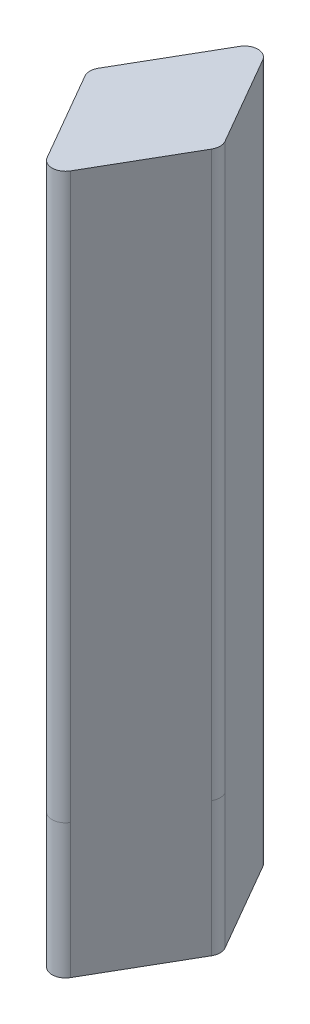
ISO-10303-21;
HEADER;
FILE_DESCRIPTION(('STEP AP214'),'2;1');
FILE_NAME('part.step','',(''),(''),'','','');
FILE_SCHEMA(('AUTOMOTIVE_DESIGN { 1 0 10303 214 1 1 1 1 }'));
ENDSEC;
DATA;
#1=APPLICATION_CONTEXT('core data for automotive mechanical design processes');
#2=APPLICATION_PROTOCOL_DEFINITION('international standard','automotive_design',2000,#1);
#3=PRODUCT_CONTEXT('',#1,'mechanical');
#4=PRODUCT('Part','Part','',(#3));
#5=PRODUCT_RELATED_PRODUCT_CATEGORY('part','',(#4));
#6=PRODUCT_DEFINITION_FORMATION('','',#4);
#7=PRODUCT_DEFINITION_CONTEXT('part definition',#1,'design');
#8=PRODUCT_DEFINITION('design','',#6,#7);
#9=PRODUCT_DEFINITION_SHAPE('','',#8);
#10=(LENGTH_UNIT() NAMED_UNIT(*) SI_UNIT(.MILLI.,.METRE.));
#11=(NAMED_UNIT(*) PLANE_ANGLE_UNIT() SI_UNIT($,.RADIAN.));
#12=(NAMED_UNIT(*) SI_UNIT($,.STERADIAN.) SOLID_ANGLE_UNIT());
#13=UNCERTAINTY_MEASURE_WITH_UNIT(LENGTH_MEASURE(1.E-05),#10,'distance_accuracy_value','');
#14=(GEOMETRIC_REPRESENTATION_CONTEXT(3) GLOBAL_UNCERTAINTY_ASSIGNED_CONTEXT((#13)) GLOBAL_UNIT_ASSIGNED_CONTEXT((#10,
#11,#12)) REPRESENTATION_CONTEXT('',''));
#15=CARTESIAN_POINT('',(0.,0.,0.));
#16=DIRECTION('',(0.,0.,1.));
#17=DIRECTION('',(1.,0.,0.));
#18=AXIS2_PLACEMENT_3D('',#15,#16,#17);
#19=CARTESIAN_POINT('',(0.,-52.,8.66025403784438));
#20=DIRECTION('',(-0.866025403784438,0.,0.500000000000001));
#21=DIRECTION('',(0.500000000000001,0.,0.866025403784438));
#22=AXIS2_PLACEMENT_3D('',#19,#20,#21);
#23=PLANE('',#22);
#24=DIRECTION('',(0.500000000000001,0.,0.866025403784438));
#25=VECTOR('',#24,1.);
#26=CARTESIAN_POINT('',(0.,0.,8.66025403784438));
#27=LINE('',#26,#25);
#28=CARTESIAN_POINT('',(-4.71132486540516,0.,0.499999999999997));
#29=VERTEX_POINT('',#28);
#30=CARTESIAN_POINT('',(-0.866025403784404,0.,7.16025403784437));
#31=VERTEX_POINT('',#30);
#32=EDGE_CURVE('E207',#29,#31,#27,.T.);
#33=ORIENTED_EDGE('',*,*,#32,.F.);
#34=DIRECTION('',(0.,1.,0.));
#35=VECTOR('',#34,1.);
#36=CARTESIAN_POINT('',(-4.71132486540516,-52.,0.499999999999999));
#37=LINE('',#36,#35);
#38=CARTESIAN_POINT('',(-4.71132486540515,-42.,0.5));
#39=VERTEX_POINT('',#38);
#40=EDGE_CURVE('E188',#29,#39,#37,.F.);
#41=ORIENTED_EDGE('',*,*,#40,.T.);
#42=DIRECTION('',(0.,-1.,0.));
#43=VECTOR('',#42,1.);
#44=CARTESIAN_POINT('',(-4.71132486540515,-42.,0.5));
#45=LINE('',#44,#43);
#46=CARTESIAN_POINT('',(-4.71132486540515,-52.,0.5));
#47=VERTEX_POINT('',#46);
#48=EDGE_CURVE('E156',#39,#47,#45,.T.);
#49=ORIENTED_EDGE('',*,*,#48,.T.);
#50=DIRECTION('',(0.500000000000001,0.,0.866025403784438));
#51=VECTOR('',#50,1.);
#52=CARTESIAN_POINT('',(0.,-52.,8.66025403784438));
#53=LINE('',#52,#51);
#54=CARTESIAN_POINT('',(-0.866025403784411,-52.,7.16025403784436));
#55=VERTEX_POINT('',#54);
#56=EDGE_CURVE('E206',#47,#55,#53,.T.);
#57=ORIENTED_EDGE('',*,*,#56,.T.);
#58=DIRECTION('',(0.,-1.,0.));
#59=VECTOR('',#58,1.);
#60=CARTESIAN_POINT('',(-0.866025403784411,-42.,7.16025403784436));
#61=LINE('',#60,#59);
#62=CARTESIAN_POINT('',(-0.866025403784411,-42.,7.16025403784436));
#63=VERTEX_POINT('',#62);
#64=EDGE_CURVE('E270',#63,#55,#61,.T.);
#65=ORIENTED_EDGE('',*,*,#64,.F.);
#66=DIRECTION('',(0.,1.,0.));
#67=VECTOR('',#66,1.);
#68=CARTESIAN_POINT('',(-0.866025403784404,-52.,7.16025403784437));
#69=LINE('',#68,#67);
#70=EDGE_CURVE('E185',#63,#31,#69,.T.);
#71=ORIENTED_EDGE('',*,*,#70,.T.);
#72=EDGE_LOOP('',(#33,#41,#49,#57,#65,#71));
#73=FACE_BOUND('',#72,.T.);
#74=ADVANCED_FACE('F36',(#73),#23,.T.);
#75=CARTESIAN_POINT('',(-4.99999999999997,-52.,0.));
#76=DIRECTION('',(-0.866025403784438,0.,-0.500000000000001));
#77=DIRECTION('',(-0.500000000000001,0.,0.866025403784438));
#78=AXIS2_PLACEMENT_3D('',#75,#76,#77);
#79=PLANE('',#78);
#80=DIRECTION('',(0.,-1.,0.));
#81=VECTOR('',#80,1.);
#82=CARTESIAN_POINT('',(-4.71132486540515,-42.,-0.500000000000008));
#83=LINE('',#82,#81);
#84=CARTESIAN_POINT('',(-4.71132486540515,-42.,-0.500000000000008));
#85=VERTEX_POINT('',#84);
#86=CARTESIAN_POINT('',(-4.71132486540516,-52.,-0.500000000000005));
#87=VERTEX_POINT('',#86);
#88=EDGE_CURVE('E153',#85,#87,#83,.T.);
#89=ORIENTED_EDGE('',*,*,#88,.F.);
#90=DIRECTION('',(0.,1.,0.));
#91=VECTOR('',#90,1.);
#92=CARTESIAN_POINT('',(-4.71132486540516,-52.,-0.500000000000003));
#93=LINE('',#92,#91);
#94=CARTESIAN_POINT('',(-4.71132486540516,0.,-0.500000000000003));
#95=VERTEX_POINT('',#94);
#96=EDGE_CURVE('E167',#85,#95,#93,.T.);
#97=ORIENTED_EDGE('',*,*,#96,.T.);
#98=DIRECTION('',(-0.500000000000001,0.,0.866025403784438));
#99=VECTOR('',#98,1.);
#100=CARTESIAN_POINT('',(-4.99999999999997,0.,0.));
#101=LINE('',#100,#99);
#102=CARTESIAN_POINT('',(-0.866025403784403,0.,-7.16025403784438));
#103=VERTEX_POINT('',#102);
#104=EDGE_CURVE('E203',#103,#95,#101,.T.);
#105=ORIENTED_EDGE('',*,*,#104,.F.);
#106=DIRECTION('',(0.,1.,0.));
#107=VECTOR('',#106,1.);
#108=CARTESIAN_POINT('',(-0.866025403784404,-52.,-7.16025403784438));
#109=LINE('',#108,#107);
#110=CARTESIAN_POINT('',(-0.866025403784411,-42.,-7.16025403784437));
#111=VERTEX_POINT('',#110);
#112=EDGE_CURVE('E175',#103,#111,#109,.F.);
#113=ORIENTED_EDGE('',*,*,#112,.T.);
#114=DIRECTION('',(0.,-1.,0.));
#115=VECTOR('',#114,1.);
#116=CARTESIAN_POINT('',(-0.866025403784411,-42.,-7.16025403784437));
#117=LINE('',#116,#115);
#118=CARTESIAN_POINT('',(-0.866025403784411,-52.,-7.16025403784437));
#119=VERTEX_POINT('',#118);
#120=EDGE_CURVE('E263',#111,#119,#117,.T.);
#121=ORIENTED_EDGE('',*,*,#120,.T.);
#122=DIRECTION('',(-0.500000000000001,0.,0.866025403784438));
#123=VECTOR('',#122,1.);
#124=CARTESIAN_POINT('',(-4.99999999999997,-52.,0.));
#125=LINE('',#124,#123);
#126=EDGE_CURVE('E171',#119,#87,#125,.T.);
#127=ORIENTED_EDGE('',*,*,#126,.T.);
#128=EDGE_LOOP('',(#89,#97,#105,#113,#121,#127));
#129=FACE_BOUND('',#128,.T.);
#130=ADVANCED_FACE('F165',(#129),#79,.T.);
#131=CARTESIAN_POINT('',(0.,-52.,-8.66025403784439));
#132=DIRECTION('',(0.866025403784442,0.,-0.499999999999995));
#133=DIRECTION('',(-0.499999999999995,0.,-0.866025403784442));
#134=AXIS2_PLACEMENT_3D('',#131,#132,#133);
#135=PLANE('',#134);
#136=DIRECTION('',(-0.499999999999995,0.,-0.866025403784442));
#137=VECTOR('',#136,1.);
#138=CARTESIAN_POINT('',(0.,0.,-8.66025403784439));
#139=LINE('',#138,#137);
#140=CARTESIAN_POINT('',(4.71132486540516,0.,-0.499999999999999));
#141=VERTEX_POINT('',#140);
#142=CARTESIAN_POINT('',(0.866025403784477,0.,-7.16025403784437));
#143=VERTEX_POINT('',#142);
#144=EDGE_CURVE('E197',#141,#143,#139,.T.);
#145=ORIENTED_EDGE('',*,*,#144,.F.);
#146=DIRECTION('',(0.,1.,0.));
#147=VECTOR('',#146,1.);
#148=CARTESIAN_POINT('',(4.71132486540516,-52.,-0.5));
#149=LINE('',#148,#147);
#150=CARTESIAN_POINT('',(4.71132486540515,-42.,-0.500000000000009));
#151=VERTEX_POINT('',#150);
#152=EDGE_CURVE('E11',#141,#151,#149,.F.);
#153=ORIENTED_EDGE('',*,*,#152,.T.);
#154=DIRECTION('',(0.,-1.,0.));
#155=VECTOR('',#154,1.);
#156=CARTESIAN_POINT('',(4.71132486540515,-42.,-0.500000000000009));
#157=LINE('',#156,#155);
#158=CARTESIAN_POINT('',(4.71132486540515,-52.,-0.500000000000009));
#159=VERTEX_POINT('',#158);
#160=EDGE_CURVE('E282',#151,#159,#157,.T.);
#161=ORIENTED_EDGE('',*,*,#160,.T.);
#162=DIRECTION('',(-0.499999999999995,0.,-0.866025403784442));
#163=VECTOR('',#162,1.);
#164=CARTESIAN_POINT('',(0.,-52.,-8.66025403784439));
#165=LINE('',#164,#163);
#166=CARTESIAN_POINT('',(0.866025403784476,-52.,-7.16025403784437));
#167=VERTEX_POINT('',#166);
#168=EDGE_CURVE('E214',#159,#167,#165,.T.);
#169=ORIENTED_EDGE('',*,*,#168,.T.);
#170=DIRECTION('',(0.,-1.,0.));
#171=VECTOR('',#170,1.);
#172=CARTESIAN_POINT('',(0.866025403784484,-42.,-7.16025403784436));
#173=LINE('',#172,#171);
#174=CARTESIAN_POINT('',(0.866025403784484,-42.,-7.16025403784436));
#175=VERTEX_POINT('',#174);
#176=EDGE_CURVE('E200',#175,#167,#173,.T.);
#177=ORIENTED_EDGE('',*,*,#176,.F.);
#178=DIRECTION('',(0.,1.,0.));
#179=VECTOR('',#178,1.);
#180=CARTESIAN_POINT('',(0.866025403784477,-52.,-7.16025403784437));
#181=LINE('',#180,#179);
#182=EDGE_CURVE('E44',#175,#143,#181,.T.);
#183=ORIENTED_EDGE('',*,*,#182,.T.);
#184=EDGE_LOOP('',(#145,#153,#161,#169,#177,#183));
#185=FACE_BOUND('',#184,.T.);
#186=ADVANCED_FACE('F196',(#185),#135,.T.);
#187=CARTESIAN_POINT('',(4.99999999999997,-52.,0.));
#188=DIRECTION('',(0.866025403784442,0.,0.499999999999994));
#189=DIRECTION('',(0.499999999999995,0.,-0.866025403784442));
#190=AXIS2_PLACEMENT_3D('',#187,#188,#189);
#191=PLANE('',#190);
#192=DIRECTION('',(0.499999999999994,0.,-0.866025403784442));
#193=VECTOR('',#192,1.);
#194=CARTESIAN_POINT('',(4.99999999999997,0.,0.));
#195=LINE('',#194,#193);
#196=CARTESIAN_POINT('',(0.866025403784476,0.,7.16025403784437));
#197=VERTEX_POINT('',#196);
#198=CARTESIAN_POINT('',(4.71132486540516,0.,0.49999999999999));
#199=VERTEX_POINT('',#198);
#200=EDGE_CURVE('E204',#197,#199,#195,.T.);
#201=ORIENTED_EDGE('',*,*,#200,.F.);
#202=DIRECTION('',(0.,1.,0.));
#203=VECTOR('',#202,1.);
#204=CARTESIAN_POINT('',(0.866025403784475,-52.,7.16025403784437));
#205=LINE('',#204,#203);
#206=CARTESIAN_POINT('',(0.866025403784489,-42.,7.16025403784436));
#207=VERTEX_POINT('',#206);
#208=EDGE_CURVE('E193',#197,#207,#205,.F.);
#209=ORIENTED_EDGE('',*,*,#208,.T.);
#210=DIRECTION('',(0.,-1.,0.));
#211=VECTOR('',#210,1.);
#212=CARTESIAN_POINT('',(0.866025403784489,-42.,7.16025403784436));
#213=LINE('',#212,#211);
#214=CARTESIAN_POINT('',(0.866025403784489,-52.,7.16025403784436));
#215=VERTEX_POINT('',#214);
#216=EDGE_CURVE('E272',#207,#215,#213,.T.);
#217=ORIENTED_EDGE('',*,*,#216,.T.);
#218=DIRECTION('',(0.499999999999994,0.,-0.866025403784442));
#219=VECTOR('',#218,1.);
#220=CARTESIAN_POINT('',(4.99999999999997,-52.,0.));
#221=LINE('',#220,#219);
#222=CARTESIAN_POINT('',(4.71132486540516,-52.,0.499999999999994));
#223=VERTEX_POINT('',#222);
#224=EDGE_CURVE('E216',#215,#223,#221,.T.);
#225=ORIENTED_EDGE('',*,*,#224,.T.);
#226=DIRECTION('',(0.,-1.,0.));
#227=VECTOR('',#226,1.);
#228=CARTESIAN_POINT('',(4.71132486540515,-42.,0.499999999999991));
#229=LINE('',#228,#227);
#230=CARTESIAN_POINT('',(4.71132486540515,-42.,0.499999999999991));
#231=VERTEX_POINT('',#230);
#232=EDGE_CURVE('E280',#231,#223,#229,.T.);
#233=ORIENTED_EDGE('',*,*,#232,.F.);
#234=DIRECTION('',(0.,1.,0.));
#235=VECTOR('',#234,1.);
#236=CARTESIAN_POINT('',(4.71132486540516,-52.,0.499999999999989));
#237=LINE('',#236,#235);
#238=EDGE_CURVE('E190',#231,#199,#237,.T.);
#239=ORIENTED_EDGE('',*,*,#238,.T.);
#240=EDGE_LOOP('',(#201,#209,#217,#225,#233,#239));
#241=FACE_BOUND('',#240,.T.);
#242=ADVANCED_FACE('F304',(#241),#191,.T.);
#243=CARTESIAN_POINT('',(0.,-52.,0.));
#244=DIRECTION('',(0.,-1.,0.));
#245=DIRECTION('',(0.,0.,-1.));
#246=AXIS2_PLACEMENT_3D('',#243,#244,#245);
#247=PLANE('',#246);
#248=CARTESIAN_POINT('',(0.,-52.,0.));
#249=DIRECTION('',(0.,1.,0.));
#250=DIRECTION('',(0.,0.,1.));
#251=AXIS2_PLACEMENT_3D('',#248,#249,#250);
#252=CIRCLE('',#251,1.5);
#253=CARTESIAN_POINT('',(0.,-52.,1.5));
#254=VERTEX_POINT('',#253);
#255=EDGE_CURVE('E244',#254,#254,#252,.T.);
#256=ORIENTED_EDGE('',*,*,#255,.T.);
#257=EDGE_LOOP('',(#256));
#258=FACE_BOUND('',#257,.T.);
#259=CARTESIAN_POINT('',(-3.84529946162072,-52.,0.));
#260=DIRECTION('',(0.,1.,0.));
#261=DIRECTION('',(0.,0.,1.));
#262=AXIS2_PLACEMENT_3D('',#259,#260,#261);
#263=CIRCLE('',#262,1.);
#264=EDGE_CURVE('E160',#87,#47,#263,.T.);
#265=ORIENTED_EDGE('',*,*,#264,.F.);
#266=ORIENTED_EDGE('',*,*,#126,.F.);
#267=CARTESIAN_POINT('',(0.,-52.,-6.66025403784438));
#268=DIRECTION('',(0.,1.,0.));
#269=DIRECTION('',(0.,0.,1.));
#270=AXIS2_PLACEMENT_3D('',#267,#268,#269);
#271=CIRCLE('',#270,0.999999999999999);
#272=EDGE_CURVE('E267',#167,#119,#271,.T.);
#273=ORIENTED_EDGE('',*,*,#272,.F.);
#274=ORIENTED_EDGE('',*,*,#168,.F.);
#275=CARTESIAN_POINT('',(3.84529946162072,-52.,0.));
#276=DIRECTION('',(0.,1.,0.));
#277=DIRECTION('',(0.,0.,1.));
#278=AXIS2_PLACEMENT_3D('',#275,#276,#277);
#279=CIRCLE('',#278,0.999999999999997);
#280=EDGE_CURVE('E276',#223,#159,#279,.T.);
#281=ORIENTED_EDGE('',*,*,#280,.F.);
#282=ORIENTED_EDGE('',*,*,#224,.F.);
#283=CARTESIAN_POINT('',(0.,-52.,6.66025403784437));
#284=DIRECTION('',(0.,1.,0.));
#285=DIRECTION('',(0.,0.,1.));
#286=AXIS2_PLACEMENT_3D('',#283,#284,#285);
#287=CIRCLE('',#286,1.00000000000001);
#288=EDGE_CURVE('E266',#55,#215,#287,.T.);
#289=ORIENTED_EDGE('',*,*,#288,.F.);
#290=ORIENTED_EDGE('',*,*,#56,.F.);
#291=EDGE_LOOP('',(#265,#266,#273,#274,#281,#282,#289,#290));
#292=FACE_BOUND('',#291,.T.);
#293=ADVANCED_FACE('F296',(#258,#292),#247,.T.);
#294=CARTESIAN_POINT('',(0.,0.,0.));
#295=DIRECTION('',(0.,-1.,0.));
#296=DIRECTION('',(0.,0.,-1.));
#297=AXIS2_PLACEMENT_3D('',#294,#295,#296);
#298=PLANE('',#297);
#299=ORIENTED_EDGE('',*,*,#104,.T.);
#300=CARTESIAN_POINT('',(-3.84529946162072,0.,0.));
#301=DIRECTION('',(0.,-1.,0.));
#302=DIRECTION('',(0.,0.,-1.));
#303=AXIS2_PLACEMENT_3D('',#300,#301,#302);
#304=CIRCLE('',#303,1.);
#305=EDGE_CURVE('E174',#95,#29,#304,.F.);
#306=ORIENTED_EDGE('',*,*,#305,.T.);
#307=ORIENTED_EDGE('',*,*,#32,.T.);
#308=CARTESIAN_POINT('',(0.,0.,6.66025403784437));
#309=DIRECTION('',(0.,-1.,0.));
#310=DIRECTION('',(0.,0.,-1.));
#311=AXIS2_PLACEMENT_3D('',#308,#309,#310);
#312=CIRCLE('',#311,1.);
#313=EDGE_CURVE('E182',#31,#197,#312,.F.);
#314=ORIENTED_EDGE('',*,*,#313,.T.);
#315=ORIENTED_EDGE('',*,*,#200,.T.);
#316=CARTESIAN_POINT('',(3.84529946162072,0.,0.));
#317=DIRECTION('',(0.,-1.,0.));
#318=DIRECTION('',(0.,0.,-1.));
#319=AXIS2_PLACEMENT_3D('',#316,#317,#318);
#320=CIRCLE('',#319,1.);
#321=EDGE_CURVE('E59',#199,#141,#320,.F.);
#322=ORIENTED_EDGE('',*,*,#321,.T.);
#323=ORIENTED_EDGE('',*,*,#144,.T.);
#324=CARTESIAN_POINT('',(0.,0.,-6.66025403784438));
#325=DIRECTION('',(0.,-1.,0.));
#326=DIRECTION('',(0.,0.,-1.));
#327=AXIS2_PLACEMENT_3D('',#324,#325,#326);
#328=CIRCLE('',#327,1.);
#329=EDGE_CURVE('E51',#143,#103,#328,.F.);
#330=ORIENTED_EDGE('',*,*,#329,.T.);
#331=EDGE_LOOP('',(#299,#306,#307,#314,#315,#322,#323,#330));
#332=FACE_BOUND('',#331,.T.);
#333=ADVANCED_FACE('F202',(#332),#298,.F.);
#334=CARTESIAN_POINT('',(3.84529946162075,-45.,0.));
#335=DIRECTION('',(0.866025403784439,0.,-0.5));
#336=DIRECTION('',(-0.5,0.,-0.866025403784439));
#337=AXIS2_PLACEMENT_3D('',#334,#335,#336);
#338=PLANE('',#337);
#339=DIRECTION('',(0.,1.,0.));
#340=VECTOR('',#339,1.);
#341=CARTESIAN_POINT('',(3.84529946162075,-45.,0.));
#342=LINE('',#341,#340);
#343=CARTESIAN_POINT('',(3.84529946162075,-45.,0.));
#344=VERTEX_POINT('',#343);
#345=CARTESIAN_POINT('',(3.84529946162075,-1.,0.));
#346=VERTEX_POINT('',#345);
#347=EDGE_CURVE('E212',#344,#346,#342,.T.);
#348=ORIENTED_EDGE('',*,*,#347,.T.);
#349=DIRECTION('',(-0.5,0.,-0.866025403784439));
#350=VECTOR('',#349,1.);
#351=CARTESIAN_POINT('',(0.,-1.,-6.66025403784432));
#352=LINE('',#351,#350);
#353=CARTESIAN_POINT('',(0.,-1.,-6.66025403784432));
#354=VERTEX_POINT('',#353);
#355=EDGE_CURVE('E253',#346,#354,#352,.T.);
#356=ORIENTED_EDGE('',*,*,#355,.T.);
#357=DIRECTION('',(0.,1.,0.));
#358=VECTOR('',#357,1.);
#359=CARTESIAN_POINT('',(0.,-45.,-6.66025403784432));
#360=LINE('',#359,#358);
#361=CARTESIAN_POINT('',(0.,-45.,-6.66025403784432));
#362=VERTEX_POINT('',#361);
#363=EDGE_CURVE('E221',#362,#354,#360,.T.);
#364=ORIENTED_EDGE('',*,*,#363,.F.);
#365=DIRECTION('',(-0.5,0.,-0.866025403784439));
#366=VECTOR('',#365,1.);
#367=CARTESIAN_POINT('',(3.84529946162075,-45.,0.));
#368=LINE('',#367,#366);
#369=EDGE_CURVE('E241',#344,#362,#368,.T.);
#370=ORIENTED_EDGE('',*,*,#369,.F.);
#371=EDGE_LOOP('',(#348,#356,#364,#370));
#372=FACE_BOUND('',#371,.T.);
#373=ADVANCED_FACE('F367',(#372),#338,.F.);
#374=CARTESIAN_POINT('',(0.,-45.,6.66025403784439));
#375=DIRECTION('',(0.866025403784439,0.,0.5));
#376=DIRECTION('',(0.5,0.,-0.866025403784439));
#377=AXIS2_PLACEMENT_3D('',#374,#375,#376);
#378=PLANE('',#377);
#379=DIRECTION('',(0.,1.,0.));
#380=VECTOR('',#379,1.);
#381=CARTESIAN_POINT('',(0.,-45.,6.66025403784439));
#382=LINE('',#381,#380);
#383=CARTESIAN_POINT('',(0.,-45.,6.66025403784439));
#384=VERTEX_POINT('',#383);
#385=CARTESIAN_POINT('',(0.,-1.,6.66025403784439));
#386=VERTEX_POINT('',#385);
#387=EDGE_CURVE('E228',#384,#386,#382,.T.);
#388=ORIENTED_EDGE('',*,*,#387,.T.);
#389=DIRECTION('',(0.5,0.,-0.866025403784439));
#390=VECTOR('',#389,1.);
#391=CARTESIAN_POINT('',(3.84529946162075,-1.,0.));
#392=LINE('',#391,#390);
#393=EDGE_CURVE('E256',#386,#346,#392,.T.);
#394=ORIENTED_EDGE('',*,*,#393,.T.);
#395=ORIENTED_EDGE('',*,*,#347,.F.);
#396=DIRECTION('',(0.5,0.,-0.866025403784439));
#397=VECTOR('',#396,1.);
#398=CARTESIAN_POINT('',(0.,-45.,6.66025403784439));
#399=LINE('',#398,#397);
#400=EDGE_CURVE('E225',#384,#344,#399,.T.);
#401=ORIENTED_EDGE('',*,*,#400,.F.);
#402=EDGE_LOOP('',(#388,#394,#395,#401));
#403=FACE_BOUND('',#402,.T.);
#404=ADVANCED_FACE('F363',(#403),#378,.F.);
#405=CARTESIAN_POINT('',(-3.84529946162071,-45.,0.));
#406=DIRECTION('',(-0.866025403784439,0.,0.5));
#407=DIRECTION('',(0.5,0.,0.866025403784439));
#408=AXIS2_PLACEMENT_3D('',#405,#406,#407);
#409=PLANE('',#408);
#410=DIRECTION('',(0.,1.,0.));
#411=VECTOR('',#410,1.);
#412=CARTESIAN_POINT('',(-3.84529946162071,-45.,0.));
#413=LINE('',#412,#411);
#414=CARTESIAN_POINT('',(-3.84529946162071,-45.,0.));
#415=VERTEX_POINT('',#414);
#416=CARTESIAN_POINT('',(-3.84529946162071,-1.00000000000001,0.));
#417=VERTEX_POINT('',#416);
#418=EDGE_CURVE('E224',#415,#417,#413,.T.);
#419=ORIENTED_EDGE('',*,*,#418,.T.);
#420=DIRECTION('',(0.5,0.,0.866025403784439));
#421=VECTOR('',#420,1.);
#422=CARTESIAN_POINT('',(0.,-1.,6.66025403784439));
#423=LINE('',#422,#421);
#424=EDGE_CURVE('E259',#417,#386,#423,.T.);
#425=ORIENTED_EDGE('',*,*,#424,.T.);
#426=ORIENTED_EDGE('',*,*,#387,.F.);
#427=DIRECTION('',(0.5,0.,0.866025403784439));
#428=VECTOR('',#427,1.);
#429=CARTESIAN_POINT('',(-3.84529946162071,-45.,0.));
#430=LINE('',#429,#428);
#431=EDGE_CURVE('E235',#415,#384,#430,.T.);
#432=ORIENTED_EDGE('',*,*,#431,.F.);
#433=EDGE_LOOP('',(#419,#425,#426,#432));
#434=FACE_BOUND('',#433,.T.);
#435=ADVANCED_FACE('F366',(#434),#409,.F.);
#436=CARTESIAN_POINT('',(0.,-45.,-6.66025403784432));
#437=DIRECTION('',(-0.866025403784439,0.,-0.5));
#438=DIRECTION('',(-0.5,0.,0.866025403784439));
#439=AXIS2_PLACEMENT_3D('',#436,#437,#438);
#440=PLANE('',#439);
#441=ORIENTED_EDGE('',*,*,#363,.T.);
#442=DIRECTION('',(-0.5,0.,0.866025403784438));
#443=VECTOR('',#442,1.);
#444=CARTESIAN_POINT('',(-3.84529946162071,-1.,0.));
#445=LINE('',#444,#443);
#446=EDGE_CURVE('E248',#354,#417,#445,.T.);
#447=ORIENTED_EDGE('',*,*,#446,.T.);
#448=ORIENTED_EDGE('',*,*,#418,.F.);
#449=DIRECTION('',(-0.5,0.,0.866025403784438));
#450=VECTOR('',#449,1.);
#451=CARTESIAN_POINT('',(0.,-45.,-6.66025403784432));
#452=LINE('',#451,#450);
#453=EDGE_CURVE('E238',#362,#415,#452,.T.);
#454=ORIENTED_EDGE('',*,*,#453,.F.);
#455=EDGE_LOOP('',(#441,#447,#448,#454));
#456=FACE_BOUND('',#455,.T.);
#457=ADVANCED_FACE('F361',(#456),#440,.F.);
#458=CARTESIAN_POINT('',(0.,-45.,0.));
#459=DIRECTION('',(0.,1.,0.));
#460=DIRECTION('',(0.,0.,1.));
#461=AXIS2_PLACEMENT_3D('',#458,#459,#460);
#462=PLANE('',#461);
#463=CARTESIAN_POINT('',(0.,-45.,0.));
#464=DIRECTION('',(0.,1.,0.));
#465=DIRECTION('',(0.,0.,1.));
#466=AXIS2_PLACEMENT_3D('',#463,#464,#465);
#467=CIRCLE('',#466,1.5);
#468=CARTESIAN_POINT('',(0.,-45.,1.5));
#469=VERTEX_POINT('',#468);
#470=EDGE_CURVE('E245',#469,#469,#467,.T.);
#471=ORIENTED_EDGE('',*,*,#470,.F.);
#472=EDGE_LOOP('',(#471));
#473=FACE_BOUND('',#472,.T.);
#474=ORIENTED_EDGE('',*,*,#369,.T.);
#475=ORIENTED_EDGE('',*,*,#453,.T.);
#476=ORIENTED_EDGE('',*,*,#431,.T.);
#477=ORIENTED_EDGE('',*,*,#400,.T.);
#478=EDGE_LOOP('',(#474,#475,#476,#477));
#479=FACE_BOUND('',#478,.T.);
#480=ADVANCED_FACE('F357',(#473,#479),#462,.T.);
#481=CARTESIAN_POINT('',(0.,-52.,0.));
#482=DIRECTION('',(0.,1.,0.));
#483=DIRECTION('',(0.,0.,1.));
#484=AXIS2_PLACEMENT_3D('',#481,#482,#483);
#485=CYLINDRICAL_SURFACE('',#484,1.5);
#486=ORIENTED_EDGE('',*,*,#255,.F.);
#487=EDGE_LOOP('',(#486));
#488=FACE_BOUND('',#487,.T.);
#489=ORIENTED_EDGE('',*,*,#470,.T.);
#490=EDGE_LOOP('',(#489));
#491=FACE_BOUND('',#490,.T.);
#492=ADVANCED_FACE('F353',(#488,#491),#485,.F.);
#493=CARTESIAN_POINT('',(0.,-1.,0.));
#494=DIRECTION('',(0.,-1.,0.));
#495=DIRECTION('',(0.,0.,-1.));
#496=AXIS2_PLACEMENT_3D('',#493,#494,#495);
#497=PLANE('',#496);
#498=ORIENTED_EDGE('',*,*,#424,.F.);
#499=ORIENTED_EDGE('',*,*,#446,.F.);
#500=ORIENTED_EDGE('',*,*,#355,.F.);
#501=ORIENTED_EDGE('',*,*,#393,.F.);
#502=EDGE_LOOP('',(#498,#499,#500,#501));
#503=FACE_BOUND('',#502,.T.);
#504=ADVANCED_FACE('F350',(#503),#497,.T.);
#505=CARTESIAN_POINT('',(0.,-42.,-6.66025403784438));
#506=DIRECTION('',(0.,-1.,0.));
#507=DIRECTION('',(0.,0.,-1.));
#508=AXIS2_PLACEMENT_3D('',#505,#506,#507);
#509=CYLINDRICAL_SURFACE('',#508,0.999999999999999);
#510=ORIENTED_EDGE('',*,*,#272,.T.);
#511=ORIENTED_EDGE('',*,*,#120,.F.);
#512=CARTESIAN_POINT('',(0.,-42.,-6.66025403784438));
#513=DIRECTION('',(0.,1.,0.));
#514=DIRECTION('',(0.,0.,1.));
#515=AXIS2_PLACEMENT_3D('',#512,#513,#514);
#516=CIRCLE('',#515,0.999999999999999);
#517=EDGE_CURVE('E264',#175,#111,#516,.T.);
#518=ORIENTED_EDGE('',*,*,#517,.F.);
#519=ORIENTED_EDGE('',*,*,#176,.T.);
#520=EDGE_LOOP('',(#510,#511,#518,#519));
#521=FACE_BOUND('',#520,.T.);
#522=ADVANCED_FACE('F312',(#521),#509,.T.);
#523=CARTESIAN_POINT('',(0.,-42.,6.66025403784437));
#524=DIRECTION('',(0.,-1.,0.));
#525=DIRECTION('',(0.,0.,-1.));
#526=AXIS2_PLACEMENT_3D('',#523,#524,#525);
#527=CYLINDRICAL_SURFACE('',#526,1.00000000000001);
#528=ORIENTED_EDGE('',*,*,#288,.T.);
#529=ORIENTED_EDGE('',*,*,#216,.F.);
#530=CARTESIAN_POINT('',(0.,-42.,6.66025403784437));
#531=DIRECTION('',(0.,1.,0.));
#532=DIRECTION('',(0.,0.,1.));
#533=AXIS2_PLACEMENT_3D('',#530,#531,#532);
#534=CIRCLE('',#533,1.00000000000001);
#535=EDGE_CURVE('E273',#63,#207,#534,.T.);
#536=ORIENTED_EDGE('',*,*,#535,.F.);
#537=ORIENTED_EDGE('',*,*,#64,.T.);
#538=EDGE_LOOP('',(#528,#529,#536,#537));
#539=FACE_BOUND('',#538,.T.);
#540=ADVANCED_FACE('F301',(#539),#527,.T.);
#541=CARTESIAN_POINT('',(3.84529946162072,-42.,0.));
#542=DIRECTION('',(0.,-1.,0.));
#543=DIRECTION('',(0.,0.,-1.));
#544=AXIS2_PLACEMENT_3D('',#541,#542,#543);
#545=CYLINDRICAL_SURFACE('',#544,0.999999999999997);
#546=ORIENTED_EDGE('',*,*,#280,.T.);
#547=ORIENTED_EDGE('',*,*,#160,.F.);
#548=CARTESIAN_POINT('',(3.84529946162072,-42.,0.));
#549=DIRECTION('',(0.,1.,0.));
#550=DIRECTION('',(0.,0.,1.));
#551=AXIS2_PLACEMENT_3D('',#548,#549,#550);
#552=CIRCLE('',#551,0.999999999999997);
#553=EDGE_CURVE('E283',#231,#151,#552,.T.);
#554=ORIENTED_EDGE('',*,*,#553,.F.);
#555=ORIENTED_EDGE('',*,*,#232,.T.);
#556=EDGE_LOOP('',(#546,#547,#554,#555));
#557=FACE_BOUND('',#556,.T.);
#558=ADVANCED_FACE('F317',(#557),#545,.T.);
#559=CARTESIAN_POINT('',(-3.84529946162072,-42.,0.));
#560=DIRECTION('',(0.,-1.,0.));
#561=DIRECTION('',(0.,0.,-1.));
#562=AXIS2_PLACEMENT_3D('',#559,#560,#561);
#563=CYLINDRICAL_SURFACE('',#562,1.);
#564=ORIENTED_EDGE('',*,*,#264,.T.);
#565=ORIENTED_EDGE('',*,*,#48,.F.);
#566=CARTESIAN_POINT('',(-3.84529946162072,-42.,0.));
#567=DIRECTION('',(0.,1.,0.));
#568=DIRECTION('',(0.,0.,1.));
#569=AXIS2_PLACEMENT_3D('',#566,#567,#568);
#570=CIRCLE('',#569,1.);
#571=EDGE_CURVE('E150',#85,#39,#570,.T.);
#572=ORIENTED_EDGE('',*,*,#571,.F.);
#573=ORIENTED_EDGE('',*,*,#88,.T.);
#574=EDGE_LOOP('',(#564,#565,#572,#573));
#575=FACE_BOUND('',#574,.T.);
#576=ADVANCED_FACE('F152',(#575),#563,.T.);
#577=CARTESIAN_POINT('',(-3.84529946162072,-52.,0.));
#578=DIRECTION('',(0.,1.,0.));
#579=DIRECTION('',(0.,0.,1.));
#580=AXIS2_PLACEMENT_3D('',#577,#578,#579);
#581=CYLINDRICAL_SURFACE('',#580,1.);
#582=ORIENTED_EDGE('',*,*,#571,.T.);
#583=ORIENTED_EDGE('',*,*,#40,.F.);
#584=ORIENTED_EDGE('',*,*,#305,.F.);
#585=ORIENTED_EDGE('',*,*,#96,.F.);
#586=EDGE_LOOP('',(#582,#583,#584,#585));
#587=FACE_BOUND('',#586,.T.);
#588=ADVANCED_FACE('F173',(#587),#581,.T.);
#589=CARTESIAN_POINT('',(0.,-52.,6.66025403784437));
#590=DIRECTION('',(0.,1.,0.));
#591=DIRECTION('',(0.,0.,1.));
#592=AXIS2_PLACEMENT_3D('',#589,#590,#591);
#593=CYLINDRICAL_SURFACE('',#592,1.);
#594=ORIENTED_EDGE('',*,*,#535,.T.);
#595=ORIENTED_EDGE('',*,*,#208,.F.);
#596=ORIENTED_EDGE('',*,*,#313,.F.);
#597=ORIENTED_EDGE('',*,*,#70,.F.);
#598=EDGE_LOOP('',(#594,#595,#596,#597));
#599=FACE_BOUND('',#598,.T.);
#600=ADVANCED_FACE('F308',(#599),#593,.T.);
#601=CARTESIAN_POINT('',(3.84529946162072,-52.,0.));
#602=DIRECTION('',(0.,1.,0.));
#603=DIRECTION('',(0.,0.,1.));
#604=AXIS2_PLACEMENT_3D('',#601,#602,#603);
#605=CYLINDRICAL_SURFACE('',#604,1.);
#606=ORIENTED_EDGE('',*,*,#553,.T.);
#607=ORIENTED_EDGE('',*,*,#152,.F.);
#608=ORIENTED_EDGE('',*,*,#321,.F.);
#609=ORIENTED_EDGE('',*,*,#238,.F.);
#610=EDGE_LOOP('',(#606,#607,#608,#609));
#611=FACE_BOUND('',#610,.T.);
#612=ADVANCED_FACE('F320',(#611),#605,.T.);
#613=CARTESIAN_POINT('',(0.,-52.,-6.66025403784438));
#614=DIRECTION('',(0.,1.,0.));
#615=DIRECTION('',(0.,0.,1.));
#616=AXIS2_PLACEMENT_3D('',#613,#614,#615);
#617=CYLINDRICAL_SURFACE('',#616,1.);
#618=ORIENTED_EDGE('',*,*,#517,.T.);
#619=ORIENTED_EDGE('',*,*,#112,.F.);
#620=ORIENTED_EDGE('',*,*,#329,.F.);
#621=ORIENTED_EDGE('',*,*,#182,.F.);
#622=EDGE_LOOP('',(#618,#619,#620,#621));
#623=FACE_BOUND('',#622,.T.);
#624=ADVANCED_FACE('F38',(#623),#617,.T.);
#625=CLOSED_SHELL('',(#74,#130,#186,#242,#293,#333,#373,#404,#435,#457,#480,#492,#504,#522,#540,
#558,#576,#588,#600,#612,#624));
#626=MANIFOLD_SOLID_BREP('B2',#625);
#627=ADVANCED_BREP_SHAPE_REPRESENTATION('',(#18,#626),#14);
#628=SHAPE_DEFINITION_REPRESENTATION(#9,#627);
ENDSEC;
END-ISO-10303-21;
